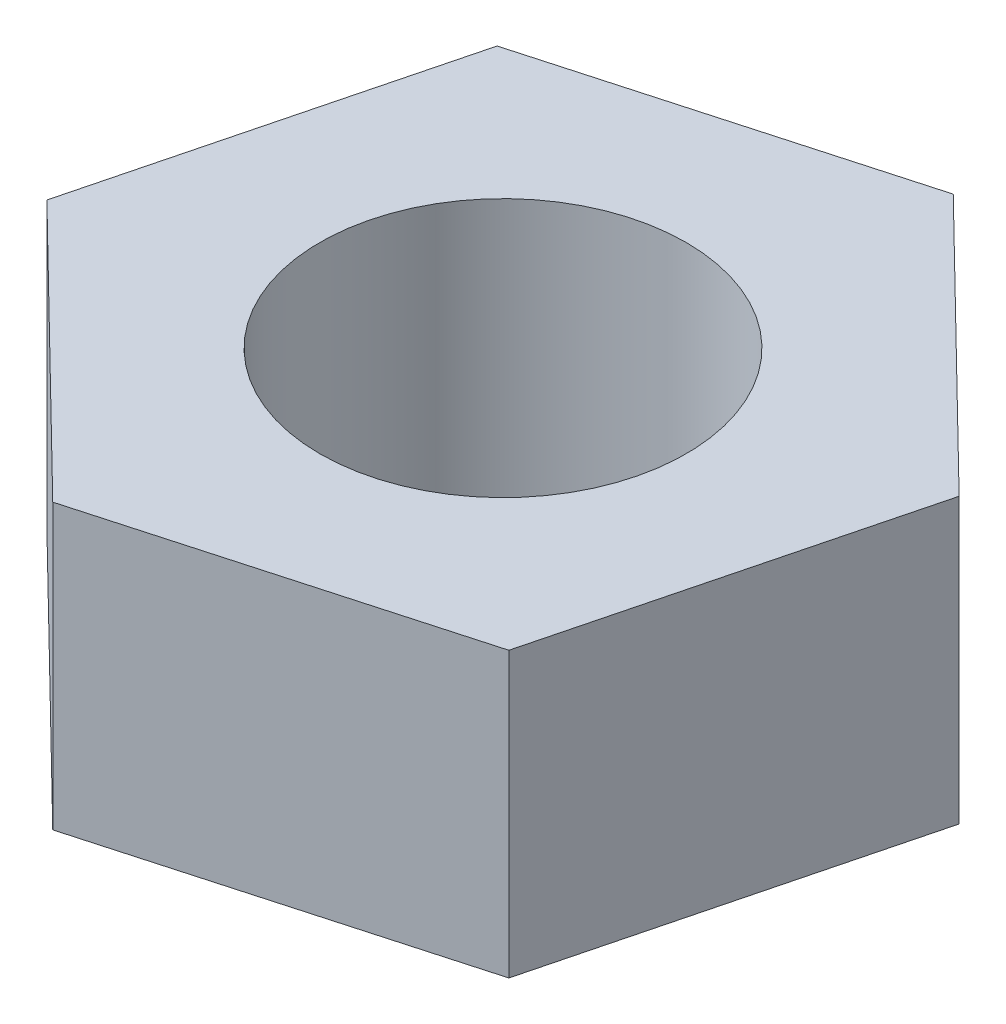
ISO-10303-21;
HEADER;
FILE_DESCRIPTION(('STEP AP214'),'2;1');
FILE_NAME('part.step','',(''),(''),'','','');
FILE_SCHEMA(('AUTOMOTIVE_DESIGN { 1 0 10303 214 1 1 1 1 }'));
ENDSEC;
DATA;
#1=APPLICATION_CONTEXT('core data for automotive mechanical design processes');
#2=APPLICATION_PROTOCOL_DEFINITION('international standard','automotive_design',2000,#1);
#3=PRODUCT_CONTEXT('',#1,'mechanical');
#4=PRODUCT('Part','Part','',(#3));
#5=PRODUCT_RELATED_PRODUCT_CATEGORY('part','',(#4));
#6=PRODUCT_DEFINITION_FORMATION('','',#4);
#7=PRODUCT_DEFINITION_CONTEXT('part definition',#1,'design');
#8=PRODUCT_DEFINITION('design','',#6,#7);
#9=PRODUCT_DEFINITION_SHAPE('','',#8);
#10=(LENGTH_UNIT() NAMED_UNIT(*) SI_UNIT(.MILLI.,.METRE.));
#11=(NAMED_UNIT(*) PLANE_ANGLE_UNIT() SI_UNIT($,.RADIAN.));
#12=(NAMED_UNIT(*) SI_UNIT($,.STERADIAN.) SOLID_ANGLE_UNIT());
#13=UNCERTAINTY_MEASURE_WITH_UNIT(LENGTH_MEASURE(1.E-05),#10,'distance_accuracy_value','');
#14=(GEOMETRIC_REPRESENTATION_CONTEXT(3) GLOBAL_UNCERTAINTY_ASSIGNED_CONTEXT((#13)) GLOBAL_UNIT_ASSIGNED_CONTEXT((#10,
#11,#12)) REPRESENTATION_CONTEXT('',''));
#15=CARTESIAN_POINT('',(0.,0.,0.));
#16=DIRECTION('',(0.,0.,1.));
#17=DIRECTION('',(1.,0.,0.));
#18=AXIS2_PLACEMENT_3D('',#15,#16,#17);
#19=CARTESIAN_POINT('',(0.,3.1,0.));
#20=DIRECTION('',(0.,1.,0.));
#21=DIRECTION('',(0.,0.,1.));
#22=AXIS2_PLACEMENT_3D('',#19,#20,#21);
#23=PLANE('',#22);
#24=DIRECTION('',(0.962956963986224,0.,-0.269655123278668));
#25=VECTOR('',#24,1.);
#26=CARTESIAN_POINT('',(-1.00207918683881,3.1,3.91524847699834));
#27=LINE('',#26,#25);
#28=CARTESIAN_POINT('',(-1.00207918683881,3.1,3.91524847699834));
#29=VERTEX_POINT('',#28);
#30=CARTESIAN_POINT('',(2.88966504978949,3.1,2.82545027090523));
#31=VERTEX_POINT('',#30);
#32=EDGE_CURVE('E146',#29,#31,#27,.T.);
#33=ORIENTED_EDGE('',*,*,#32,.T.);
#34=DIRECTION('',(0.247950294973161,0.,-0.968772755202541));
#35=VECTOR('',#34,1.);
#36=CARTESIAN_POINT('',(2.88966504978949,3.1,2.82545027090523));
#37=LINE('',#36,#35);
#38=CARTESIAN_POINT('',(3.8917442366283,3.1,-1.08979820609311));
#39=VERTEX_POINT('',#38);
#40=EDGE_CURVE('E94',#31,#39,#37,.T.);
#41=ORIENTED_EDGE('',*,*,#40,.T.);
#42=DIRECTION('',(-0.715006669013063,0.,-0.699117631923873));
#43=VECTOR('',#42,1.);
#44=CARTESIAN_POINT('',(3.8917442366283,3.1,-1.08979820609311));
#45=LINE('',#44,#43);
#46=CARTESIAN_POINT('',(1.00207918683881,3.1,-3.91524847699834));
#47=VERTEX_POINT('',#46);
#48=EDGE_CURVE('E107',#39,#47,#45,.T.);
#49=ORIENTED_EDGE('',*,*,#48,.T.);
#50=DIRECTION('',(-0.962956963986224,0.,0.269655123278668));
#51=VECTOR('',#50,1.);
#52=CARTESIAN_POINT('',(1.00207918683881,3.1,-3.91524847699834));
#53=LINE('',#52,#51);
#54=CARTESIAN_POINT('',(-2.88966504978949,3.1,-2.82545027090523));
#55=VERTEX_POINT('',#54);
#56=EDGE_CURVE('E101',#47,#55,#53,.T.);
#57=ORIENTED_EDGE('',*,*,#56,.T.);
#58=DIRECTION('',(-0.247950294973161,0.,0.968772755202541));
#59=VECTOR('',#58,1.);
#60=CARTESIAN_POINT('',(-2.88966504978949,3.1,-2.82545027090523));
#61=LINE('',#60,#59);
#62=CARTESIAN_POINT('',(-3.8917442366283,3.1,1.08979820609311));
#63=VERTEX_POINT('',#62);
#64=EDGE_CURVE('E105',#55,#63,#61,.T.);
#65=ORIENTED_EDGE('',*,*,#64,.T.);
#66=DIRECTION('',(0.715006669013063,0.,0.699117631923873));
#67=VECTOR('',#66,1.);
#68=CARTESIAN_POINT('',(-3.8917442366283,3.1,1.08979820609311));
#69=LINE('',#68,#67);
#70=EDGE_CURVE('E57',#63,#29,#69,.T.);
#71=ORIENTED_EDGE('',*,*,#70,.T.);
#72=EDGE_LOOP('',(#33,#41,#49,#57,#65,#71));
#73=FACE_BOUND('',#72,.T.);
#74=CARTESIAN_POINT('',(0.,3.1,0.));
#75=DIRECTION('',(0.,1.,0.));
#76=DIRECTION('',(0.,0.,1.));
#77=AXIS2_PLACEMENT_3D('',#74,#75,#76);
#78=CIRCLE('',#77,2.);
#79=CARTESIAN_POINT('',(0.,3.1,2.));
#80=VERTEX_POINT('',#79);
#81=EDGE_CURVE('E134',#80,#80,#78,.T.);
#82=ORIENTED_EDGE('',*,*,#81,.F.);
#83=EDGE_LOOP('',(#82));
#84=FACE_BOUND('',#83,.T.);
#85=ADVANCED_FACE('F39',(#73,#84),#23,.T.);
#86=CARTESIAN_POINT('',(0.,0.,0.));
#87=DIRECTION('',(0.,1.,0.));
#88=DIRECTION('',(0.,0.,1.));
#89=AXIS2_PLACEMENT_3D('',#86,#87,#88);
#90=PLANE('',#89);
#91=DIRECTION('',(0.962956963986224,0.,-0.269655123278668));
#92=VECTOR('',#91,1.);
#93=CARTESIAN_POINT('',(-1.00207918683881,0.,3.91524847699834));
#94=LINE('',#93,#92);
#95=CARTESIAN_POINT('',(-1.00207918683881,0.,3.91524847699834));
#96=VERTEX_POINT('',#95);
#97=CARTESIAN_POINT('',(2.88966504978949,0.,2.82545027090523));
#98=VERTEX_POINT('',#97);
#99=EDGE_CURVE('E129',#96,#98,#94,.T.);
#100=ORIENTED_EDGE('',*,*,#99,.F.);
#101=DIRECTION('',(0.715006669013063,0.,0.699117631923873));
#102=VECTOR('',#101,1.);
#103=CARTESIAN_POINT('',(-3.8917442366283,0.,1.08979820609311));
#104=LINE('',#103,#102);
#105=CARTESIAN_POINT('',(-3.8917442366283,0.,1.08979820609311));
#106=VERTEX_POINT('',#105);
#107=EDGE_CURVE('E86',#106,#96,#104,.T.);
#108=ORIENTED_EDGE('',*,*,#107,.F.);
#109=DIRECTION('',(-0.247950294973161,0.,0.968772755202541));
#110=VECTOR('',#109,1.);
#111=CARTESIAN_POINT('',(-2.88966504978949,0.,-2.82545027090523));
#112=LINE('',#111,#110);
#113=CARTESIAN_POINT('',(-2.88966504978949,0.,-2.82545027090523));
#114=VERTEX_POINT('',#113);
#115=EDGE_CURVE('E80',#114,#106,#112,.T.);
#116=ORIENTED_EDGE('',*,*,#115,.F.);
#117=DIRECTION('',(-0.962956963986224,0.,0.269655123278668));
#118=VECTOR('',#117,1.);
#119=CARTESIAN_POINT('',(1.00207918683881,0.,-3.91524847699834));
#120=LINE('',#119,#118);
#121=CARTESIAN_POINT('',(1.00207918683881,0.,-3.91524847699834));
#122=VERTEX_POINT('',#121);
#123=EDGE_CURVE('E116',#122,#114,#120,.T.);
#124=ORIENTED_EDGE('',*,*,#123,.F.);
#125=DIRECTION('',(-0.715006669013063,0.,-0.699117631923873));
#126=VECTOR('',#125,1.);
#127=CARTESIAN_POINT('',(3.8917442366283,0.,-1.08979820609311));
#128=LINE('',#127,#126);
#129=CARTESIAN_POINT('',(3.8917442366283,0.,-1.08979820609311));
#130=VERTEX_POINT('',#129);
#131=EDGE_CURVE('E137',#130,#122,#128,.T.);
#132=ORIENTED_EDGE('',*,*,#131,.F.);
#133=DIRECTION('',(0.247950294973161,0.,-0.968772755202541));
#134=VECTOR('',#133,1.);
#135=CARTESIAN_POINT('',(2.88966504978949,0.,2.82545027090523));
#136=LINE('',#135,#134);
#137=EDGE_CURVE('E133',#98,#130,#136,.T.);
#138=ORIENTED_EDGE('',*,*,#137,.F.);
#139=EDGE_LOOP('',(#100,#108,#116,#124,#132,#138));
#140=FACE_BOUND('',#139,.T.);
#141=CARTESIAN_POINT('',(0.,0.,0.));
#142=DIRECTION('',(0.,1.,0.));
#143=DIRECTION('',(0.,0.,1.));
#144=AXIS2_PLACEMENT_3D('',#141,#142,#143);
#145=CIRCLE('',#144,2.);
#146=CARTESIAN_POINT('',(0.,0.,2.));
#147=VERTEX_POINT('',#146);
#148=EDGE_CURVE('E243',#147,#147,#145,.T.);
#149=ORIENTED_EDGE('',*,*,#148,.T.);
#150=EDGE_LOOP('',(#149));
#151=FACE_BOUND('',#150,.T.);
#152=ADVANCED_FACE('F159',(#140,#151),#90,.F.);
#153=CARTESIAN_POINT('',(-1.00207918683881,3.1,3.91524847699834));
#154=DIRECTION('',(-0.269655123278668,0.,-0.962956963986224));
#155=DIRECTION('',(-0.962956963986224,0.,0.269655123278668));
#156=AXIS2_PLACEMENT_3D('',#153,#154,#155);
#157=PLANE('',#156);
#158=ORIENTED_EDGE('',*,*,#99,.T.);
#159=DIRECTION('',(0.,-1.,0.));
#160=VECTOR('',#159,1.);
#161=CARTESIAN_POINT('',(2.88966504978949,3.1,2.82545027090523));
#162=LINE('',#161,#160);
#163=EDGE_CURVE('E11',#31,#98,#162,.T.);
#164=ORIENTED_EDGE('',*,*,#163,.F.);
#165=ORIENTED_EDGE('',*,*,#32,.F.);
#166=DIRECTION('',(0.,-1.,0.));
#167=VECTOR('',#166,1.);
#168=CARTESIAN_POINT('',(-1.00207918683881,3.1,3.91524847699834));
#169=LINE('',#168,#167);
#170=EDGE_CURVE('E125',#29,#96,#169,.T.);
#171=ORIENTED_EDGE('',*,*,#170,.T.);
#172=EDGE_LOOP('',(#158,#164,#165,#171));
#173=FACE_BOUND('',#172,.T.);
#174=ADVANCED_FACE('F41',(#173),#157,.F.);
#175=CARTESIAN_POINT('',(2.88966504978949,3.1,2.82545027090523));
#176=DIRECTION('',(-0.968772755202541,0.,-0.247950294973161));
#177=DIRECTION('',(-0.247950294973161,0.,0.968772755202541));
#178=AXIS2_PLACEMENT_3D('',#175,#176,#177);
#179=PLANE('',#178);
#180=ORIENTED_EDGE('',*,*,#137,.T.);
#181=DIRECTION('',(0.,-1.,0.));
#182=VECTOR('',#181,1.);
#183=CARTESIAN_POINT('',(3.8917442366283,3.1,-1.08979820609311));
#184=LINE('',#183,#182);
#185=EDGE_CURVE('E49',#39,#130,#184,.T.);
#186=ORIENTED_EDGE('',*,*,#185,.F.);
#187=ORIENTED_EDGE('',*,*,#40,.F.);
#188=ORIENTED_EDGE('',*,*,#163,.T.);
#189=EDGE_LOOP('',(#180,#186,#187,#188));
#190=FACE_BOUND('',#189,.T.);
#191=ADVANCED_FACE('F184',(#190),#179,.F.);
#192=CARTESIAN_POINT('',(3.8917442366283,3.1,-1.08979820609311));
#193=DIRECTION('',(-0.699117631923873,0.,0.715006669013063));
#194=DIRECTION('',(0.715006669013063,0.,0.699117631923873));
#195=AXIS2_PLACEMENT_3D('',#192,#193,#194);
#196=PLANE('',#195);
#197=ORIENTED_EDGE('',*,*,#131,.T.);
#198=DIRECTION('',(0.,-1.,0.));
#199=VECTOR('',#198,1.);
#200=CARTESIAN_POINT('',(1.00207918683881,3.1,-3.91524847699834));
#201=LINE('',#200,#199);
#202=EDGE_CURVE('E118',#47,#122,#201,.T.);
#203=ORIENTED_EDGE('',*,*,#202,.F.);
#204=ORIENTED_EDGE('',*,*,#48,.F.);
#205=ORIENTED_EDGE('',*,*,#185,.T.);
#206=EDGE_LOOP('',(#197,#203,#204,#205));
#207=FACE_BOUND('',#206,.T.);
#208=ADVANCED_FACE('F156',(#207),#196,.F.);
#209=CARTESIAN_POINT('',(1.00207918683881,3.1,-3.91524847699834));
#210=DIRECTION('',(0.269655123278668,0.,0.962956963986224));
#211=DIRECTION('',(0.962956963986224,0.,-0.269655123278668));
#212=AXIS2_PLACEMENT_3D('',#209,#210,#211);
#213=PLANE('',#212);
#214=ORIENTED_EDGE('',*,*,#123,.T.);
#215=DIRECTION('',(0.,-1.,0.));
#216=VECTOR('',#215,1.);
#217=CARTESIAN_POINT('',(-2.88966504978949,3.1,-2.82545027090523));
#218=LINE('',#217,#216);
#219=EDGE_CURVE('E113',#55,#114,#218,.T.);
#220=ORIENTED_EDGE('',*,*,#219,.F.);
#221=ORIENTED_EDGE('',*,*,#56,.F.);
#222=ORIENTED_EDGE('',*,*,#202,.T.);
#223=EDGE_LOOP('',(#214,#220,#221,#222));
#224=FACE_BOUND('',#223,.T.);
#225=ADVANCED_FACE('F114',(#224),#213,.F.);
#226=CARTESIAN_POINT('',(-2.88966504978949,3.1,-2.82545027090523));
#227=DIRECTION('',(0.968772755202541,0.,0.247950294973161));
#228=DIRECTION('',(0.247950294973161,0.,-0.968772755202541));
#229=AXIS2_PLACEMENT_3D('',#226,#227,#228);
#230=PLANE('',#229);
#231=ORIENTED_EDGE('',*,*,#115,.T.);
#232=DIRECTION('',(0.,-1.,0.));
#233=VECTOR('',#232,1.);
#234=CARTESIAN_POINT('',(-3.8917442366283,3.1,1.08979820609311));
#235=LINE('',#234,#233);
#236=EDGE_CURVE('E119',#63,#106,#235,.T.);
#237=ORIENTED_EDGE('',*,*,#236,.F.);
#238=ORIENTED_EDGE('',*,*,#64,.F.);
#239=ORIENTED_EDGE('',*,*,#219,.T.);
#240=EDGE_LOOP('',(#231,#237,#238,#239));
#241=FACE_BOUND('',#240,.T.);
#242=ADVANCED_FACE('F121',(#241),#230,.F.);
#243=CARTESIAN_POINT('',(-3.8917442366283,3.1,1.08979820609311));
#244=DIRECTION('',(0.699117631923873,0.,-0.715006669013063));
#245=DIRECTION('',(-0.715006669013063,0.,-0.699117631923873));
#246=AXIS2_PLACEMENT_3D('',#243,#244,#245);
#247=PLANE('',#246);
#248=ORIENTED_EDGE('',*,*,#107,.T.);
#249=ORIENTED_EDGE('',*,*,#170,.F.);
#250=ORIENTED_EDGE('',*,*,#70,.F.);
#251=ORIENTED_EDGE('',*,*,#236,.T.);
#252=EDGE_LOOP('',(#248,#249,#250,#251));
#253=FACE_BOUND('',#252,.T.);
#254=ADVANCED_FACE('F164',(#253),#247,.F.);
#255=CARTESIAN_POINT('',(0.,3.1,0.));
#256=DIRECTION('',(0.,-1.,0.));
#257=DIRECTION('',(0.,0.,-1.));
#258=AXIS2_PLACEMENT_3D('',#255,#256,#257);
#259=CYLINDRICAL_SURFACE('',#258,2.);
#260=ORIENTED_EDGE('',*,*,#81,.T.);
#261=EDGE_LOOP('',(#260));
#262=FACE_BOUND('',#261,.T.);
#263=ORIENTED_EDGE('',*,*,#148,.F.);
#264=EDGE_LOOP('',(#263));
#265=FACE_BOUND('',#264,.T.);
#266=ADVANCED_FACE('F166',(#262,#265),#259,.F.);
#267=CLOSED_SHELL('',(#85,#152,#174,#191,#208,#225,#242,#254,#266));
#268=MANIFOLD_SOLID_BREP('B2',#267);
#269=ADVANCED_BREP_SHAPE_REPRESENTATION('',(#18,#268),#14);
#270=SHAPE_DEFINITION_REPRESENTATION(#9,#269);
ENDSEC;
END-ISO-10303-21;
